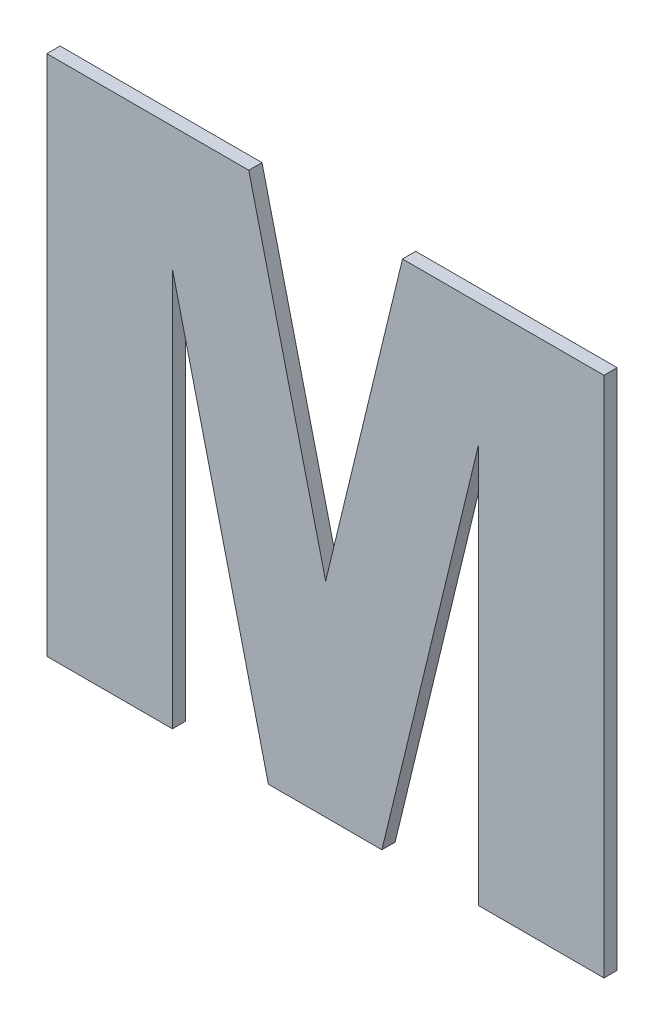
ISO-10303-21;
HEADER;
FILE_DESCRIPTION(('STEP AP214'),'2;1');
FILE_NAME('part.step','',(''),(''),'','','');
FILE_SCHEMA(('AUTOMOTIVE_DESIGN { 1 0 10303 214 1 1 1 1 }'));
ENDSEC;
DATA;
#1=APPLICATION_CONTEXT('core data for automotive mechanical design processes');
#2=APPLICATION_PROTOCOL_DEFINITION('international standard','automotive_design',2000,#1);
#3=PRODUCT_CONTEXT('',#1,'mechanical');
#4=PRODUCT('Part','Part','',(#3));
#5=PRODUCT_RELATED_PRODUCT_CATEGORY('part','',(#4));
#6=PRODUCT_DEFINITION_FORMATION('','',#4);
#7=PRODUCT_DEFINITION_CONTEXT('part definition',#1,'design');
#8=PRODUCT_DEFINITION('design','',#6,#7);
#9=PRODUCT_DEFINITION_SHAPE('','',#8);
#10=(LENGTH_UNIT() NAMED_UNIT(*) SI_UNIT(.MILLI.,.METRE.));
#11=(NAMED_UNIT(*) PLANE_ANGLE_UNIT() SI_UNIT($,.RADIAN.));
#12=(NAMED_UNIT(*) SI_UNIT($,.STERADIAN.) SOLID_ANGLE_UNIT());
#13=UNCERTAINTY_MEASURE_WITH_UNIT(LENGTH_MEASURE(1.E-05),#10,'distance_accuracy_value','');
#14=(GEOMETRIC_REPRESENTATION_CONTEXT(3) GLOBAL_UNCERTAINTY_ASSIGNED_CONTEXT((#13)) GLOBAL_UNIT_ASSIGNED_CONTEXT((#10,
#11,#12)) REPRESENTATION_CONTEXT('',''));
#15=CARTESIAN_POINT('',(0.,0.,0.));
#16=DIRECTION('',(0.,0.,1.));
#17=DIRECTION('',(1.,0.,0.));
#18=AXIS2_PLACEMENT_3D('',#15,#16,#17);
#19=CARTESIAN_POINT('',(0.425411604818767,-0.604008281971269,0.));
#20=DIRECTION('',(-0.971924748883,0.23529190914419,0.));
#21=DIRECTION('',(-0.23529190914419,-0.971924748883,0.));
#22=AXIS2_PLACEMENT_3D('',#19,#20,#21);
#23=PLANE('',#22);
#24=DIRECTION('',(-0.23529190914419,-0.971924748883,0.));
#25=VECTOR('',#24,1.);
#26=CARTESIAN_POINT('',(0.425411604818767,-0.604008281971269,0.));
#27=LINE('',#26,#25);
#28=CARTESIAN_POINT('',(0.425411604818767,-0.604008281971269,0.));
#29=VERTEX_POINT('',#28);
#30=CARTESIAN_POINT('',(0.407952817742367,-0.676125624665926,0.));
#31=VERTEX_POINT('',#30);
#32=EDGE_CURVE('E11',#29,#31,#27,.T.);
#33=ORIENTED_EDGE('',*,*,#32,.T.);
#34=DIRECTION('',(0.,0.,1.));
#35=VECTOR('',#34,1.);
#36=CARTESIAN_POINT('',(0.407952817742367,-0.676125624665926,0.));
#37=LINE('',#36,#35);
#38=CARTESIAN_POINT('',(0.407952817742367,-0.676125624665926,0.003));
#39=VERTEX_POINT('',#38);
#40=EDGE_CURVE('E24',#31,#39,#37,.T.);
#41=ORIENTED_EDGE('',*,*,#40,.T.);
#42=DIRECTION('',(-0.23529190914419,-0.971924748883,0.));
#43=VECTOR('',#42,1.);
#44=CARTESIAN_POINT('',(0.425411604818767,-0.604008281971269,0.003));
#45=LINE('',#44,#43);
#46=CARTESIAN_POINT('',(0.425411604818767,-0.604008281971269,0.003));
#47=VERTEX_POINT('',#46);
#48=EDGE_CURVE('E130',#47,#39,#45,.T.);
#49=ORIENTED_EDGE('',*,*,#48,.F.);
#50=DIRECTION('',(0.,0.,1.));
#51=VECTOR('',#50,1.);
#52=CARTESIAN_POINT('',(0.425411604818767,-0.604008281971269,0.));
#53=LINE('',#52,#51);
#54=EDGE_CURVE('E221',#29,#47,#53,.T.);
#55=ORIENTED_EDGE('',*,*,#54,.F.);
#56=EDGE_LOOP('',(#33,#41,#49,#55));
#57=FACE_BOUND('',#56,.T.);
#58=ADVANCED_FACE('F17',(#57),#23,.T.);
#59=CARTESIAN_POINT('',(0.47116960231965,-0.604008281971269,0.));
#60=DIRECTION('',(0.,1.,0.));
#61=DIRECTION('',(-1.,0.,0.));
#62=AXIS2_PLACEMENT_3D('',#59,#60,#61);
#63=PLANE('',#62);
#64=DIRECTION('',(-1.,0.,0.));
#65=VECTOR('',#64,1.);
#66=CARTESIAN_POINT('',(0.47116960231965,-0.604008281971269,0.));
#67=LINE('',#66,#65);
#68=CARTESIAN_POINT('',(0.47116960231965,-0.604008281971269,0.));
#69=VERTEX_POINT('',#68);
#70=EDGE_CURVE('E218',#69,#29,#67,.T.);
#71=ORIENTED_EDGE('',*,*,#70,.T.);
#72=ORIENTED_EDGE('',*,*,#54,.T.);
#73=DIRECTION('',(-1.,0.,0.));
#74=VECTOR('',#73,1.);
#75=CARTESIAN_POINT('',(0.47116960231965,-0.604008281971269,0.003));
#76=LINE('',#75,#74);
#77=CARTESIAN_POINT('',(0.47116960231965,-0.604008281971269,0.003));
#78=VERTEX_POINT('',#77);
#79=EDGE_CURVE('E216',#78,#47,#76,.T.);
#80=ORIENTED_EDGE('',*,*,#79,.F.);
#81=DIRECTION('',(0.,0.,1.));
#82=VECTOR('',#81,1.);
#83=CARTESIAN_POINT('',(0.47116960231965,-0.604008281971269,0.));
#84=LINE('',#83,#82);
#85=EDGE_CURVE('E213',#69,#78,#84,.T.);
#86=ORIENTED_EDGE('',*,*,#85,.F.);
#87=EDGE_LOOP('',(#71,#72,#80,#86));
#88=FACE_BOUND('',#87,.T.);
#89=ADVANCED_FACE('F253',(#88),#63,.T.);
#90=CARTESIAN_POINT('',(0.47116960231965,-0.722568280483534,0.));
#91=DIRECTION('',(1.,0.,0.));
#92=DIRECTION('',(0.,1.,0.));
#93=AXIS2_PLACEMENT_3D('',#90,#91,#92);
#94=PLANE('',#93);
#95=DIRECTION('',(0.,1.,0.));
#96=VECTOR('',#95,1.);
#97=CARTESIAN_POINT('',(0.47116960231965,-0.722568280483534,0.));
#98=LINE('',#97,#96);
#99=CARTESIAN_POINT('',(0.47116960231965,-0.722568280483534,0.));
#100=VERTEX_POINT('',#99);
#101=EDGE_CURVE('E210',#100,#69,#98,.T.);
#102=ORIENTED_EDGE('',*,*,#101,.T.);
#103=ORIENTED_EDGE('',*,*,#85,.T.);
#104=DIRECTION('',(0.,1.,0.));
#105=VECTOR('',#104,1.);
#106=CARTESIAN_POINT('',(0.47116960231965,-0.722568280483534,0.003));
#107=LINE('',#106,#105);
#108=CARTESIAN_POINT('',(0.47116960231965,-0.722568280483534,0.003));
#109=VERTEX_POINT('',#108);
#110=EDGE_CURVE('E207',#109,#78,#107,.T.);
#111=ORIENTED_EDGE('',*,*,#110,.F.);
#112=DIRECTION('',(0.,0.,1.));
#113=VECTOR('',#112,1.);
#114=CARTESIAN_POINT('',(0.47116960231965,-0.722568280483534,0.));
#115=LINE('',#114,#113);
#116=EDGE_CURVE('E204',#100,#109,#115,.T.);
#117=ORIENTED_EDGE('',*,*,#116,.F.);
#118=EDGE_LOOP('',(#102,#103,#111,#117));
#119=FACE_BOUND('',#118,.T.);
#120=ADVANCED_FACE('F250',(#119),#94,.T.);
#121=CARTESIAN_POINT('',(0.442642172456256,-0.722568280483534,0.));
#122=DIRECTION('',(0.,-1.,0.));
#123=DIRECTION('',(1.,0.,0.));
#124=AXIS2_PLACEMENT_3D('',#121,#122,#123);
#125=PLANE('',#124);
#126=DIRECTION('',(1.,0.,0.));
#127=VECTOR('',#126,1.);
#128=CARTESIAN_POINT('',(0.442642172456256,-0.722568280483534,0.));
#129=LINE('',#128,#127);
#130=CARTESIAN_POINT('',(0.442642172456256,-0.722568280483534,0.));
#131=VERTEX_POINT('',#130);
#132=EDGE_CURVE('E201',#131,#100,#129,.T.);
#133=ORIENTED_EDGE('',*,*,#132,.T.);
#134=ORIENTED_EDGE('',*,*,#116,.T.);
#135=DIRECTION('',(1.,0.,0.));
#136=VECTOR('',#135,1.);
#137=CARTESIAN_POINT('',(0.442642172456256,-0.722568280483534,0.003));
#138=LINE('',#137,#136);
#139=CARTESIAN_POINT('',(0.442642172456256,-0.722568280483534,0.003));
#140=VERTEX_POINT('',#139);
#141=EDGE_CURVE('E198',#140,#109,#138,.T.);
#142=ORIENTED_EDGE('',*,*,#141,.F.);
#143=DIRECTION('',(0.,0.,1.));
#144=VECTOR('',#143,1.);
#145=CARTESIAN_POINT('',(0.442642172456256,-0.722568280483534,0.));
#146=LINE('',#145,#144);
#147=EDGE_CURVE('E195',#131,#140,#146,.T.);
#148=ORIENTED_EDGE('',*,*,#147,.F.);
#149=EDGE_LOOP('',(#133,#134,#142,#148));
#150=FACE_BOUND('',#149,.T.);
#151=ADVANCED_FACE('F247',(#150),#125,.T.);
#152=CARTESIAN_POINT('',(0.442642172456256,-0.632079272956845,0.));
#153=DIRECTION('',(-1.,0.,0.));
#154=DIRECTION('',(0.,-1.,0.));
#155=AXIS2_PLACEMENT_3D('',#152,#153,#154);
#156=PLANE('',#155);
#157=DIRECTION('',(0.,-1.,0.));
#158=VECTOR('',#157,1.);
#159=CARTESIAN_POINT('',(0.442642172456256,-0.632079272956845,0.));
#160=LINE('',#159,#158);
#161=CARTESIAN_POINT('',(0.442642172456256,-0.632079272956845,0.));
#162=VERTEX_POINT('',#161);
#163=EDGE_CURVE('E192',#162,#131,#160,.T.);
#164=ORIENTED_EDGE('',*,*,#163,.T.);
#165=ORIENTED_EDGE('',*,*,#147,.T.);
#166=DIRECTION('',(0.,-1.,0.));
#167=VECTOR('',#166,1.);
#168=CARTESIAN_POINT('',(0.442642172456256,-0.632079272956845,0.003));
#169=LINE('',#168,#167);
#170=CARTESIAN_POINT('',(0.442642172456256,-0.632079272956845,0.003));
#171=VERTEX_POINT('',#170);
#172=EDGE_CURVE('E189',#171,#140,#169,.T.);
#173=ORIENTED_EDGE('',*,*,#172,.F.);
#174=DIRECTION('',(0.,0.,1.));
#175=VECTOR('',#174,1.);
#176=CARTESIAN_POINT('',(0.442642172456256,-0.632079272956845,0.));
#177=LINE('',#176,#175);
#178=EDGE_CURVE('E186',#162,#171,#177,.T.);
#179=ORIENTED_EDGE('',*,*,#178,.F.);
#180=EDGE_LOOP('',(#164,#165,#173,#179));
#181=FACE_BOUND('',#180,.T.);
#182=ADVANCED_FACE('F244',(#181),#156,.T.);
#183=CARTESIAN_POINT('',(0.420733106321168,-0.722568280483534,0.));
#184=DIRECTION('',(0.971918096217999,-0.23531938773501,0.));
#185=DIRECTION('',(0.23531938773501,0.971918096217999,0.));
#186=AXIS2_PLACEMENT_3D('',#183,#184,#185);
#187=PLANE('',#186);
#188=DIRECTION('',(0.23531938773501,0.971918096217999,0.));
#189=VECTOR('',#188,1.);
#190=CARTESIAN_POINT('',(0.420733106321168,-0.722568280483534,0.));
#191=LINE('',#190,#189);
#192=CARTESIAN_POINT('',(0.420733106321168,-0.722568280483534,0.));
#193=VERTEX_POINT('',#192);
#194=EDGE_CURVE('E183',#193,#162,#191,.T.);
#195=ORIENTED_EDGE('',*,*,#194,.T.);
#196=ORIENTED_EDGE('',*,*,#178,.T.);
#197=DIRECTION('',(0.23531938773501,0.971918096217999,0.));
#198=VECTOR('',#197,1.);
#199=CARTESIAN_POINT('',(0.420733106321168,-0.722568280483534,0.003));
#200=LINE('',#199,#198);
#201=CARTESIAN_POINT('',(0.420733106321168,-0.722568280483534,0.003));
#202=VERTEX_POINT('',#201);
#203=EDGE_CURVE('E180',#202,#171,#200,.T.);
#204=ORIENTED_EDGE('',*,*,#203,.F.);
#205=DIRECTION('',(0.,0.,1.));
#206=VECTOR('',#205,1.);
#207=CARTESIAN_POINT('',(0.420733106321168,-0.722568280483534,0.));
#208=LINE('',#207,#206);
#209=EDGE_CURVE('E177',#193,#202,#208,.T.);
#210=ORIENTED_EDGE('',*,*,#209,.F.);
#211=EDGE_LOOP('',(#195,#196,#204,#210));
#212=FACE_BOUND('',#211,.T.);
#213=ADVANCED_FACE('F241',(#212),#187,.T.);
#214=CARTESIAN_POINT('',(0.39494430972466,-0.722568280483534,0.));
#215=DIRECTION('',(0.,-1.,0.));
#216=DIRECTION('',(1.,0.,0.));
#217=AXIS2_PLACEMENT_3D('',#214,#215,#216);
#218=PLANE('',#217);
#219=DIRECTION('',(1.,0.,0.));
#220=VECTOR('',#219,1.);
#221=CARTESIAN_POINT('',(0.39494430972466,-0.722568280483534,0.));
#222=LINE('',#221,#220);
#223=CARTESIAN_POINT('',(0.39494430972466,-0.722568280483534,0.));
#224=VERTEX_POINT('',#223);
#225=EDGE_CURVE('E174',#224,#193,#222,.T.);
#226=ORIENTED_EDGE('',*,*,#225,.T.);
#227=ORIENTED_EDGE('',*,*,#209,.T.);
#228=DIRECTION('',(1.,0.,0.));
#229=VECTOR('',#228,1.);
#230=CARTESIAN_POINT('',(0.39494430972466,-0.722568280483534,0.003));
#231=LINE('',#230,#229);
#232=CARTESIAN_POINT('',(0.39494430972466,-0.722568280483534,0.003));
#233=VERTEX_POINT('',#232);
#234=EDGE_CURVE('E171',#233,#202,#231,.T.);
#235=ORIENTED_EDGE('',*,*,#234,.F.);
#236=DIRECTION('',(0.,0.,1.));
#237=VECTOR('',#236,1.);
#238=CARTESIAN_POINT('',(0.39494430972466,-0.722568280483534,0.));
#239=LINE('',#238,#237);
#240=EDGE_CURVE('E168',#224,#233,#239,.T.);
#241=ORIENTED_EDGE('',*,*,#240,.F.);
#242=EDGE_LOOP('',(#226,#227,#235,#241));
#243=FACE_BOUND('',#242,.T.);
#244=ADVANCED_FACE('F238',(#243),#218,.T.);
#245=CARTESIAN_POINT('',(0.373149353309027,-0.632079272956845,0.));
#246=DIRECTION('',(-0.972197800331163,-0.234161134758199,0.));
#247=DIRECTION('',(0.234161134758199,-0.972197800331163,0.));
#248=AXIS2_PLACEMENT_3D('',#245,#246,#247);
#249=PLANE('',#248);
#250=DIRECTION('',(0.234161134758199,-0.972197800331163,0.));
#251=VECTOR('',#250,1.);
#252=CARTESIAN_POINT('',(0.373149353309027,-0.632079272956845,0.));
#253=LINE('',#252,#251);
#254=CARTESIAN_POINT('',(0.373149353309027,-0.632079272956845,0.));
#255=VERTEX_POINT('',#254);
#256=EDGE_CURVE('E165',#255,#224,#253,.T.);
#257=ORIENTED_EDGE('',*,*,#256,.T.);
#258=ORIENTED_EDGE('',*,*,#240,.T.);
#259=DIRECTION('',(0.234161134758199,-0.972197800331163,0.));
#260=VECTOR('',#259,1.);
#261=CARTESIAN_POINT('',(0.373149353309027,-0.632079272956845,0.003));
#262=LINE('',#261,#260);
#263=CARTESIAN_POINT('',(0.373149353309027,-0.632079272956845,0.003));
#264=VERTEX_POINT('',#263);
#265=EDGE_CURVE('E162',#264,#233,#262,.T.);
#266=ORIENTED_EDGE('',*,*,#265,.F.);
#267=DIRECTION('',(0.,0.,1.));
#268=VECTOR('',#267,1.);
#269=CARTESIAN_POINT('',(0.373149353309027,-0.632079272956845,0.));
#270=LINE('',#269,#268);
#271=EDGE_CURVE('E159',#255,#264,#270,.T.);
#272=ORIENTED_EDGE('',*,*,#271,.F.);
#273=EDGE_LOOP('',(#257,#258,#266,#272));
#274=FACE_BOUND('',#273,.T.);
#275=ADVANCED_FACE('F235',(#274),#249,.T.);
#276=CARTESIAN_POINT('',(0.373149353309027,-0.722568280483534,0.));
#277=DIRECTION('',(1.,0.,0.));
#278=DIRECTION('',(0.,1.,0.));
#279=AXIS2_PLACEMENT_3D('',#276,#277,#278);
#280=PLANE('',#279);
#281=DIRECTION('',(0.,1.,0.));
#282=VECTOR('',#281,1.);
#283=CARTESIAN_POINT('',(0.373149353309027,-0.722568280483534,0.));
#284=LINE('',#283,#282);
#285=CARTESIAN_POINT('',(0.373149353309027,-0.722568280483534,0.));
#286=VERTEX_POINT('',#285);
#287=EDGE_CURVE('E156',#286,#255,#284,.T.);
#288=ORIENTED_EDGE('',*,*,#287,.T.);
#289=ORIENTED_EDGE('',*,*,#271,.T.);
#290=DIRECTION('',(0.,1.,0.));
#291=VECTOR('',#290,1.);
#292=CARTESIAN_POINT('',(0.373149353309027,-0.722568280483534,0.003));
#293=LINE('',#292,#291);
#294=CARTESIAN_POINT('',(0.373149353309027,-0.722568280483534,0.003));
#295=VERTEX_POINT('',#294);
#296=EDGE_CURVE('E153',#295,#264,#293,.T.);
#297=ORIENTED_EDGE('',*,*,#296,.F.);
#298=DIRECTION('',(0.,0.,1.));
#299=VECTOR('',#298,1.);
#300=CARTESIAN_POINT('',(0.373149353309027,-0.722568280483534,0.));
#301=LINE('',#300,#299);
#302=EDGE_CURVE('E150',#286,#295,#301,.T.);
#303=ORIENTED_EDGE('',*,*,#302,.F.);
#304=EDGE_LOOP('',(#288,#289,#297,#303));
#305=FACE_BOUND('',#304,.T.);
#306=ADVANCED_FACE('F232',(#305),#280,.T.);
#307=CARTESIAN_POINT('',(0.344621923445633,-0.722568280483534,0.));
#308=DIRECTION('',(0.,-1.,0.));
#309=DIRECTION('',(1.,0.,0.));
#310=AXIS2_PLACEMENT_3D('',#307,#308,#309);
#311=PLANE('',#310);
#312=DIRECTION('',(1.,0.,0.));
#313=VECTOR('',#312,1.);
#314=CARTESIAN_POINT('',(0.344621923445633,-0.722568280483534,0.));
#315=LINE('',#314,#313);
#316=CARTESIAN_POINT('',(0.344621923445633,-0.722568280483534,0.));
#317=VERTEX_POINT('',#316);
#318=EDGE_CURVE('E147',#317,#286,#315,.T.);
#319=ORIENTED_EDGE('',*,*,#318,.T.);
#320=ORIENTED_EDGE('',*,*,#302,.T.);
#321=DIRECTION('',(1.,0.,0.));
#322=VECTOR('',#321,1.);
#323=CARTESIAN_POINT('',(0.344621923445633,-0.722568280483534,0.003));
#324=LINE('',#323,#322);
#325=CARTESIAN_POINT('',(0.344621923445633,-0.722568280483534,0.003));
#326=VERTEX_POINT('',#325);
#327=EDGE_CURVE('E144',#326,#295,#324,.T.);
#328=ORIENTED_EDGE('',*,*,#327,.F.);
#329=DIRECTION('',(0.,0.,1.));
#330=VECTOR('',#329,1.);
#331=CARTESIAN_POINT('',(0.344621923445633,-0.722568280483534,0.));
#332=LINE('',#331,#330);
#333=EDGE_CURVE('E141',#317,#326,#332,.T.);
#334=ORIENTED_EDGE('',*,*,#333,.F.);
#335=EDGE_LOOP('',(#319,#320,#328,#334));
#336=FACE_BOUND('',#335,.T.);
#337=ADVANCED_FACE('F229',(#336),#311,.T.);
#338=CARTESIAN_POINT('',(0.344621923445633,-0.604008281971269,0.));
#339=DIRECTION('',(-1.,0.,0.));
#340=DIRECTION('',(0.,-1.,0.));
#341=AXIS2_PLACEMENT_3D('',#338,#339,#340);
#342=PLANE('',#341);
#343=DIRECTION('',(0.,-1.,0.));
#344=VECTOR('',#343,1.);
#345=CARTESIAN_POINT('',(0.344621923445633,-0.604008281971269,0.));
#346=LINE('',#345,#344);
#347=CARTESIAN_POINT('',(0.344621923445633,-0.604008281971269,0.));
#348=VERTEX_POINT('',#347);
#349=EDGE_CURVE('E138',#348,#317,#346,.T.);
#350=ORIENTED_EDGE('',*,*,#349,.T.);
#351=ORIENTED_EDGE('',*,*,#333,.T.);
#352=DIRECTION('',(0.,-1.,0.));
#353=VECTOR('',#352,1.);
#354=CARTESIAN_POINT('',(0.344621923445633,-0.604008281971269,0.003));
#355=LINE('',#354,#353);
#356=CARTESIAN_POINT('',(0.344621923445633,-0.604008281971269,0.003));
#357=VERTEX_POINT('',#356);
#358=EDGE_CURVE('E136',#357,#326,#355,.T.);
#359=ORIENTED_EDGE('',*,*,#358,.F.);
#360=DIRECTION('',(0.,0.,1.));
#361=VECTOR('',#360,1.);
#362=CARTESIAN_POINT('',(0.344621923445633,-0.604008281971269,0.));
#363=LINE('',#362,#361);
#364=EDGE_CURVE('E115',#348,#357,#363,.T.);
#365=ORIENTED_EDGE('',*,*,#364,.F.);
#366=EDGE_LOOP('',(#350,#351,#359,#365));
#367=FACE_BOUND('',#366,.T.);
#368=ADVANCED_FACE('F227',(#367),#342,.T.);
#369=CARTESIAN_POINT('',(0.390494030665971,-0.604008281971269,0.));
#370=DIRECTION('',(0.,1.,0.));
#371=DIRECTION('',(-1.,0.,0.));
#372=AXIS2_PLACEMENT_3D('',#369,#370,#371);
#373=PLANE('',#372);
#374=DIRECTION('',(-1.,0.,0.));
#375=VECTOR('',#374,1.);
#376=CARTESIAN_POINT('',(0.390494030665971,-0.604008281971269,0.));
#377=LINE('',#376,#375);
#378=CARTESIAN_POINT('',(0.390494030665971,-0.604008281971269,0.));
#379=VERTEX_POINT('',#378);
#380=EDGE_CURVE('E119',#379,#348,#377,.T.);
#381=ORIENTED_EDGE('',*,*,#380,.T.);
#382=ORIENTED_EDGE('',*,*,#364,.T.);
#383=DIRECTION('',(-1.,0.,0.));
#384=VECTOR('',#383,1.);
#385=CARTESIAN_POINT('',(0.390494030665971,-0.604008281971269,0.003));
#386=LINE('',#385,#384);
#387=CARTESIAN_POINT('',(0.390494030665971,-0.604008281971269,0.003));
#388=VERTEX_POINT('',#387);
#389=EDGE_CURVE('E108',#388,#357,#386,.T.);
#390=ORIENTED_EDGE('',*,*,#389,.F.);
#391=DIRECTION('',(0.,0.,1.));
#392=VECTOR('',#391,1.);
#393=CARTESIAN_POINT('',(0.390494030665971,-0.604008281971269,0.));
#394=LINE('',#393,#392);
#395=EDGE_CURVE('E112',#379,#388,#394,.T.);
#396=ORIENTED_EDGE('',*,*,#395,.F.);
#397=EDGE_LOOP('',(#381,#382,#390,#396));
#398=FACE_BOUND('',#397,.T.);
#399=ADVANCED_FACE('F111',(#398),#373,.T.);
#400=CARTESIAN_POINT('',(0.407952817742367,-0.676125624665926,0.));
#401=DIRECTION('',(0.971924748883011,0.235291909144145,0.));
#402=DIRECTION('',(-0.235291909144145,0.971924748883011,0.));
#403=AXIS2_PLACEMENT_3D('',#400,#401,#402);
#404=PLANE('',#403);
#405=DIRECTION('',(-0.235291909144145,0.971924748883011,0.));
#406=VECTOR('',#405,1.);
#407=CARTESIAN_POINT('',(0.407952817742367,-0.676125624665926,0.));
#408=LINE('',#407,#406);
#409=EDGE_CURVE('E125',#31,#379,#408,.T.);
#410=ORIENTED_EDGE('',*,*,#409,.T.);
#411=ORIENTED_EDGE('',*,*,#395,.T.);
#412=DIRECTION('',(-0.235291909144145,0.971924748883011,0.));
#413=VECTOR('',#412,1.);
#414=CARTESIAN_POINT('',(0.407952817742367,-0.676125624665926,0.003));
#415=LINE('',#414,#413);
#416=EDGE_CURVE('E124',#39,#388,#415,.T.);
#417=ORIENTED_EDGE('',*,*,#416,.F.);
#418=ORIENTED_EDGE('',*,*,#40,.F.);
#419=EDGE_LOOP('',(#410,#411,#417,#418));
#420=FACE_BOUND('',#419,.T.);
#421=ADVANCED_FACE('F123',(#420),#404,.T.);
#422=CARTESIAN_POINT('',(0.407895762882641,-0.663288281227402,0.003));
#423=DIRECTION('',(0.,0.,1.));
#424=DIRECTION('',(1.,0.,0.));
#425=AXIS2_PLACEMENT_3D('',#422,#423,#424);
#426=PLANE('',#425);
#427=ORIENTED_EDGE('',*,*,#416,.T.);
#428=ORIENTED_EDGE('',*,*,#389,.T.);
#429=ORIENTED_EDGE('',*,*,#358,.T.);
#430=ORIENTED_EDGE('',*,*,#327,.T.);
#431=ORIENTED_EDGE('',*,*,#296,.T.);
#432=ORIENTED_EDGE('',*,*,#265,.T.);
#433=ORIENTED_EDGE('',*,*,#234,.T.);
#434=ORIENTED_EDGE('',*,*,#203,.T.);
#435=ORIENTED_EDGE('',*,*,#172,.T.);
#436=ORIENTED_EDGE('',*,*,#141,.T.);
#437=ORIENTED_EDGE('',*,*,#110,.T.);
#438=ORIENTED_EDGE('',*,*,#79,.T.);
#439=ORIENTED_EDGE('',*,*,#48,.T.);
#440=EDGE_LOOP('',(#427,#428,#429,#430,#431,#432,#433,#434,#435,#436,#437,#438,#439));
#441=FACE_BOUND('',#440,.T.);
#442=ADVANCED_FACE('F128',(#441),#426,.T.);
#443=CARTESIAN_POINT('',(0.407895762882641,-0.663288281227402,0.));
#444=DIRECTION('',(0.,0.,1.));
#445=DIRECTION('',(1.,0.,0.));
#446=AXIS2_PLACEMENT_3D('',#443,#444,#445);
#447=PLANE('',#446);
#448=ORIENTED_EDGE('',*,*,#409,.F.);
#449=ORIENTED_EDGE('',*,*,#32,.F.);
#450=ORIENTED_EDGE('',*,*,#70,.F.);
#451=ORIENTED_EDGE('',*,*,#101,.F.);
#452=ORIENTED_EDGE('',*,*,#132,.F.);
#453=ORIENTED_EDGE('',*,*,#163,.F.);
#454=ORIENTED_EDGE('',*,*,#194,.F.);
#455=ORIENTED_EDGE('',*,*,#225,.F.);
#456=ORIENTED_EDGE('',*,*,#256,.F.);
#457=ORIENTED_EDGE('',*,*,#287,.F.);
#458=ORIENTED_EDGE('',*,*,#318,.F.);
#459=ORIENTED_EDGE('',*,*,#349,.F.);
#460=ORIENTED_EDGE('',*,*,#380,.F.);
#461=EDGE_LOOP('',(#448,#449,#450,#451,#452,#453,#454,#455,#456,#457,#458,#459,#460));
#462=FACE_BOUND('',#461,.T.);
#463=ADVANCED_FACE('F224',(#462),#447,.F.);
#464=CLOSED_SHELL('',(#58,#89,#120,#151,#182,#213,#244,#275,#306,#337,#368,#399,#421,#442,#463));
#465=MANIFOLD_SOLID_BREP('B1',#464);
#466=ADVANCED_BREP_SHAPE_REPRESENTATION('',(#18,#465),#14);
#467=SHAPE_DEFINITION_REPRESENTATION(#9,#466);
ENDSEC;
END-ISO-10303-21;
